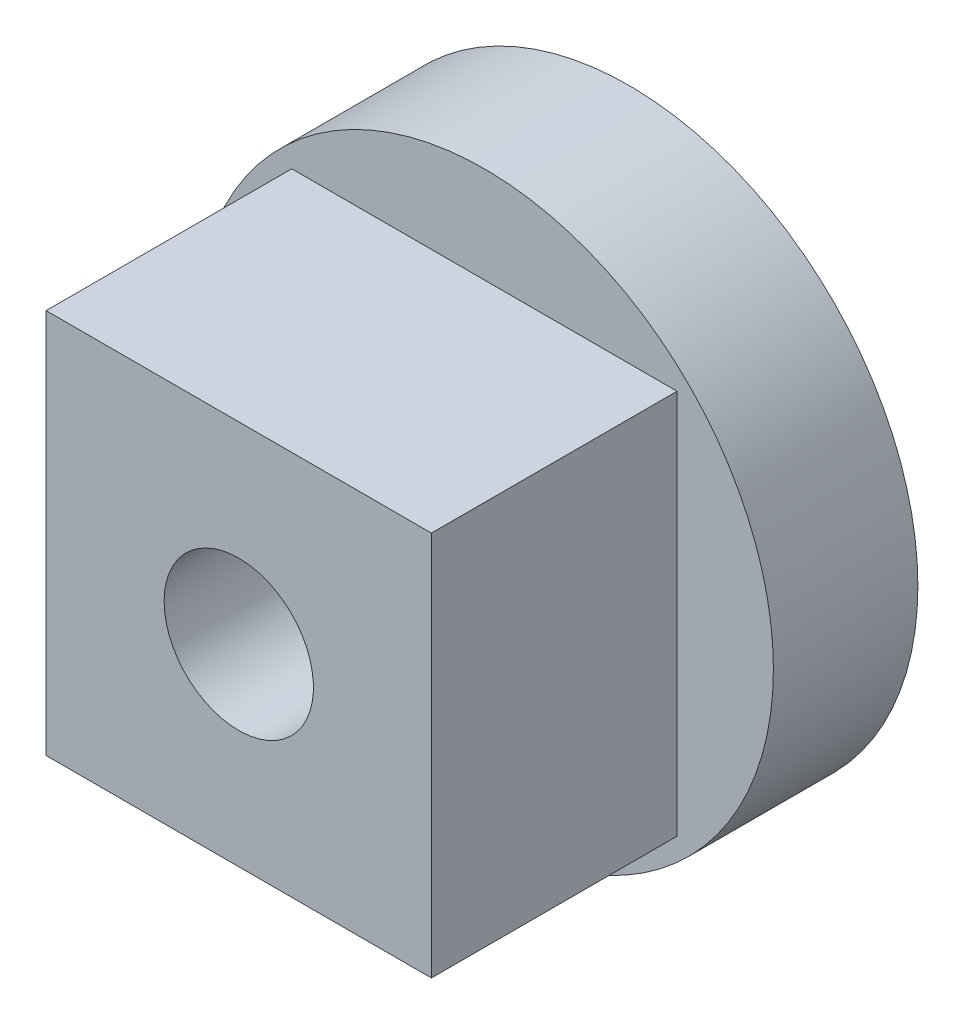
ISO-10303-21;
HEADER;
FILE_DESCRIPTION(('STEP AP214'),'2;1');
FILE_NAME('part.step','',(''),(''),'','','');
FILE_SCHEMA(('AUTOMOTIVE_DESIGN { 1 0 10303 214 1 1 1 1 }'));
ENDSEC;
DATA;
#1=APPLICATION_CONTEXT('core data for automotive mechanical design processes');
#2=APPLICATION_PROTOCOL_DEFINITION('international standard','automotive_design',2000,#1);
#3=PRODUCT_CONTEXT('',#1,'mechanical');
#4=PRODUCT('Part','Part','',(#3));
#5=PRODUCT_RELATED_PRODUCT_CATEGORY('part','',(#4));
#6=PRODUCT_DEFINITION_FORMATION('','',#4);
#7=PRODUCT_DEFINITION_CONTEXT('part definition',#1,'design');
#8=PRODUCT_DEFINITION('design','',#6,#7);
#9=PRODUCT_DEFINITION_SHAPE('','',#8);
#10=(LENGTH_UNIT() NAMED_UNIT(*) SI_UNIT(.MILLI.,.METRE.));
#11=(NAMED_UNIT(*) PLANE_ANGLE_UNIT() SI_UNIT($,.RADIAN.));
#12=(NAMED_UNIT(*) SI_UNIT($,.STERADIAN.) SOLID_ANGLE_UNIT());
#13=UNCERTAINTY_MEASURE_WITH_UNIT(LENGTH_MEASURE(1.E-05),#10,'distance_accuracy_value','');
#14=(GEOMETRIC_REPRESENTATION_CONTEXT(3) GLOBAL_UNCERTAINTY_ASSIGNED_CONTEXT((#13)) GLOBAL_UNIT_ASSIGNED_CONTEXT((#10,
#11,#12)) REPRESENTATION_CONTEXT('',''));
#15=CARTESIAN_POINT('',(0.,0.,0.));
#16=DIRECTION('',(0.,0.,1.));
#17=DIRECTION('',(1.,0.,0.));
#18=AXIS2_PLACEMENT_3D('',#15,#16,#17);
#19=CARTESIAN_POINT('',(0.,0.,3.));
#20=DIRECTION('',(0.,0.,-1.));
#21=DIRECTION('',(-1.,0.,0.));
#22=AXIS2_PLACEMENT_3D('',#19,#20,#21);
#23=CYLINDRICAL_SURFACE('',#22,6.);
#24=CARTESIAN_POINT('',(0.,0.,3.));
#25=DIRECTION('',(0.,0.,1.));
#26=DIRECTION('',(1.,0.,0.));
#27=AXIS2_PLACEMENT_3D('',#24,#25,#26);
#28=CIRCLE('',#27,6.);
#29=CARTESIAN_POINT('',(6.,0.,3.));
#30=VERTEX_POINT('',#29);
#31=EDGE_CURVE('E11',#30,#30,#28,.T.);
#32=ORIENTED_EDGE('',*,*,#31,.F.);
#33=EDGE_LOOP('',(#32));
#34=FACE_BOUND('',#33,.T.);
#35=CARTESIAN_POINT('',(0.,0.,0.));
#36=DIRECTION('',(0.,0.,1.));
#37=DIRECTION('',(1.,0.,0.));
#38=AXIS2_PLACEMENT_3D('',#35,#36,#37);
#39=CIRCLE('',#38,6.);
#40=CARTESIAN_POINT('',(6.,0.,0.));
#41=VERTEX_POINT('',#40);
#42=EDGE_CURVE('E42',#41,#41,#39,.T.);
#43=ORIENTED_EDGE('',*,*,#42,.T.);
#44=EDGE_LOOP('',(#43));
#45=FACE_BOUND('',#44,.T.);
#46=ADVANCED_FACE('F39',(#34,#45),#23,.T.);
#47=CARTESIAN_POINT('',(0.,0.,3.));
#48=DIRECTION('',(0.,0.,1.));
#49=DIRECTION('',(1.,0.,0.));
#50=AXIS2_PLACEMENT_3D('',#47,#48,#49);
#51=PLANE('',#50);
#52=DIRECTION('',(0.,-1.,0.));
#53=VECTOR('',#52,1.);
#54=CARTESIAN_POINT('',(-4.,-4.,3.));
#55=LINE('',#54,#53);
#56=CARTESIAN_POINT('',(-4.,4.,3.));
#57=VERTEX_POINT('',#56);
#58=CARTESIAN_POINT('',(-4.,-4.,3.));
#59=VERTEX_POINT('',#58);
#60=EDGE_CURVE('E53',#57,#59,#55,.T.);
#61=ORIENTED_EDGE('',*,*,#60,.F.);
#62=DIRECTION('',(-1.,0.,0.));
#63=VECTOR('',#62,1.);
#64=CARTESIAN_POINT('',(4.,4.,3.));
#65=LINE('',#64,#63);
#66=CARTESIAN_POINT('',(4.,4.,3.));
#67=VERTEX_POINT('',#66);
#68=EDGE_CURVE('E57',#67,#57,#65,.T.);
#69=ORIENTED_EDGE('',*,*,#68,.F.);
#70=DIRECTION('',(0.,1.,0.));
#71=VECTOR('',#70,1.);
#72=CARTESIAN_POINT('',(4.,-4.,3.));
#73=LINE('',#72,#71);
#74=CARTESIAN_POINT('',(4.,-4.,3.));
#75=VERTEX_POINT('',#74);
#76=EDGE_CURVE('E109',#75,#67,#73,.T.);
#77=ORIENTED_EDGE('',*,*,#76,.F.);
#78=DIRECTION('',(1.,0.,0.));
#79=VECTOR('',#78,1.);
#80=CARTESIAN_POINT('',(4.,-4.,3.));
#81=LINE('',#80,#79);
#82=EDGE_CURVE('E111',#59,#75,#81,.T.);
#83=ORIENTED_EDGE('',*,*,#82,.F.);
#84=EDGE_LOOP('',(#61,#69,#77,#83));
#85=FACE_BOUND('',#84,.T.);
#86=ORIENTED_EDGE('',*,*,#31,.T.);
#87=EDGE_LOOP('',(#86));
#88=FACE_BOUND('',#87,.T.);
#89=ADVANCED_FACE('F151',(#85,#88),#51,.T.);
#90=CARTESIAN_POINT('',(0.,0.,0.));
#91=DIRECTION('',(0.,0.,1.));
#92=DIRECTION('',(1.,0.,0.));
#93=AXIS2_PLACEMENT_3D('',#90,#91,#92);
#94=PLANE('',#93);
#95=CARTESIAN_POINT('',(0.,0.,0.));
#96=DIRECTION('',(0.,0.,-1.));
#97=DIRECTION('',(-1.,0.,0.));
#98=AXIS2_PLACEMENT_3D('',#95,#96,#97);
#99=CIRCLE('',#98,2.85);
#100=CARTESIAN_POINT('',(-2.85,0.,0.));
#101=VERTEX_POINT('',#100);
#102=EDGE_CURVE('E117',#101,#101,#99,.T.);
#103=ORIENTED_EDGE('',*,*,#102,.F.);
#104=EDGE_LOOP('',(#103));
#105=FACE_BOUND('',#104,.T.);
#106=ORIENTED_EDGE('',*,*,#42,.F.);
#107=EDGE_LOOP('',(#106));
#108=FACE_BOUND('',#107,.T.);
#109=ADVANCED_FACE('F148',(#105,#108),#94,.F.);
#110=CARTESIAN_POINT('',(-4.,-4.,8.1));
#111=DIRECTION('',(1.,0.,0.));
#112=DIRECTION('',(0.,0.,-1.));
#113=AXIS2_PLACEMENT_3D('',#110,#111,#112);
#114=PLANE('',#113);
#115=ORIENTED_EDGE('',*,*,#60,.T.);
#116=DIRECTION('',(0.,0.,-1.));
#117=VECTOR('',#116,1.);
#118=CARTESIAN_POINT('',(-4.,-4.,8.1));
#119=LINE('',#118,#117);
#120=CARTESIAN_POINT('',(-4.,-4.,8.1));
#121=VERTEX_POINT('',#120);
#122=EDGE_CURVE('E82',#121,#59,#119,.T.);
#123=ORIENTED_EDGE('',*,*,#122,.F.);
#124=DIRECTION('',(0.,-1.,0.));
#125=VECTOR('',#124,1.);
#126=CARTESIAN_POINT('',(-4.,-4.,8.1));
#127=LINE('',#126,#125);
#128=CARTESIAN_POINT('',(-4.,4.,8.1));
#129=VERTEX_POINT('',#128);
#130=EDGE_CURVE('E88',#129,#121,#127,.T.);
#131=ORIENTED_EDGE('',*,*,#130,.F.);
#132=DIRECTION('',(0.,0.,-1.));
#133=VECTOR('',#132,1.);
#134=CARTESIAN_POINT('',(-4.,4.,8.1));
#135=LINE('',#134,#133);
#136=EDGE_CURVE('E106',#129,#57,#135,.T.);
#137=ORIENTED_EDGE('',*,*,#136,.T.);
#138=EDGE_LOOP('',(#115,#123,#131,#137));
#139=FACE_BOUND('',#138,.T.);
#140=ADVANCED_FACE('F98',(#139),#114,.F.);
#141=CARTESIAN_POINT('',(4.,-4.,8.1));
#142=DIRECTION('',(0.,1.,0.));
#143=DIRECTION('',(0.,0.,1.));
#144=AXIS2_PLACEMENT_3D('',#141,#142,#143);
#145=PLANE('',#144);
#146=ORIENTED_EDGE('',*,*,#82,.T.);
#147=DIRECTION('',(0.,0.,-1.));
#148=VECTOR('',#147,1.);
#149=CARTESIAN_POINT('',(4.,-4.,8.1));
#150=LINE('',#149,#148);
#151=CARTESIAN_POINT('',(4.,-4.,8.1));
#152=VERTEX_POINT('',#151);
#153=EDGE_CURVE('E84',#152,#75,#150,.T.);
#154=ORIENTED_EDGE('',*,*,#153,.F.);
#155=DIRECTION('',(1.,0.,0.));
#156=VECTOR('',#155,1.);
#157=CARTESIAN_POINT('',(4.,-4.,8.1));
#158=LINE('',#157,#156);
#159=EDGE_CURVE('E77',#121,#152,#158,.T.);
#160=ORIENTED_EDGE('',*,*,#159,.F.);
#161=ORIENTED_EDGE('',*,*,#122,.T.);
#162=EDGE_LOOP('',(#146,#154,#160,#161));
#163=FACE_BOUND('',#162,.T.);
#164=ADVANCED_FACE('F80',(#163),#145,.F.);
#165=CARTESIAN_POINT('',(4.,-4.,8.1));
#166=DIRECTION('',(-1.,0.,0.));
#167=DIRECTION('',(0.,0.,1.));
#168=AXIS2_PLACEMENT_3D('',#165,#166,#167);
#169=PLANE('',#168);
#170=ORIENTED_EDGE('',*,*,#76,.T.);
#171=DIRECTION('',(0.,0.,-1.));
#172=VECTOR('',#171,1.);
#173=CARTESIAN_POINT('',(4.,4.,8.1));
#174=LINE('',#173,#172);
#175=CARTESIAN_POINT('',(4.,4.,8.1));
#176=VERTEX_POINT('',#175);
#177=EDGE_CURVE('E101',#176,#67,#174,.T.);
#178=ORIENTED_EDGE('',*,*,#177,.F.);
#179=DIRECTION('',(0.,1.,0.));
#180=VECTOR('',#179,1.);
#181=CARTESIAN_POINT('',(4.,-4.,8.1));
#182=LINE('',#181,#180);
#183=EDGE_CURVE('E87',#152,#176,#182,.T.);
#184=ORIENTED_EDGE('',*,*,#183,.F.);
#185=ORIENTED_EDGE('',*,*,#153,.T.);
#186=EDGE_LOOP('',(#170,#178,#184,#185));
#187=FACE_BOUND('',#186,.T.);
#188=ADVANCED_FACE('F169',(#187),#169,.F.);
#189=CARTESIAN_POINT('',(4.,4.,8.1));
#190=DIRECTION('',(0.,-1.,0.));
#191=DIRECTION('',(0.,0.,-1.));
#192=AXIS2_PLACEMENT_3D('',#189,#190,#191);
#193=PLANE('',#192);
#194=ORIENTED_EDGE('',*,*,#68,.T.);
#195=ORIENTED_EDGE('',*,*,#136,.F.);
#196=DIRECTION('',(-1.,0.,0.));
#197=VECTOR('',#196,1.);
#198=CARTESIAN_POINT('',(4.,4.,8.1));
#199=LINE('',#198,#197);
#200=EDGE_CURVE('E93',#176,#129,#199,.T.);
#201=ORIENTED_EDGE('',*,*,#200,.F.);
#202=ORIENTED_EDGE('',*,*,#177,.T.);
#203=EDGE_LOOP('',(#194,#195,#201,#202));
#204=FACE_BOUND('',#203,.T.);
#205=ADVANCED_FACE('F172',(#204),#193,.F.);
#206=CARTESIAN_POINT('',(0.,0.,8.1));
#207=DIRECTION('',(0.,0.,1.));
#208=DIRECTION('',(1.,0.,0.));
#209=AXIS2_PLACEMENT_3D('',#206,#207,#208);
#210=PLANE('',#209);
#211=CARTESIAN_POINT('',(0.,0.,8.1));
#212=DIRECTION('',(0.,0.,-1.));
#213=DIRECTION('',(-1.,0.,0.));
#214=AXIS2_PLACEMENT_3D('',#211,#212,#213);
#215=CIRCLE('',#214,1.55);
#216=CARTESIAN_POINT('',(-1.55,0.,8.1));
#217=VERTEX_POINT('',#216);
#218=EDGE_CURVE('E120',#217,#217,#215,.T.);
#219=ORIENTED_EDGE('',*,*,#218,.T.);
#220=EDGE_LOOP('',(#219));
#221=FACE_BOUND('',#220,.T.);
#222=ORIENTED_EDGE('',*,*,#130,.T.);
#223=ORIENTED_EDGE('',*,*,#159,.T.);
#224=ORIENTED_EDGE('',*,*,#183,.T.);
#225=ORIENTED_EDGE('',*,*,#200,.T.);
#226=EDGE_LOOP('',(#222,#223,#224,#225));
#227=FACE_BOUND('',#226,.T.);
#228=ADVANCED_FACE('F91',(#221,#227),#210,.T.);
#229=CARTESIAN_POINT('',(0.,0.,1.));
#230=DIRECTION('',(0.,0.,-1.));
#231=DIRECTION('',(-1.,0.,0.));
#232=AXIS2_PLACEMENT_3D('',#229,#230,#231);
#233=CYLINDRICAL_SURFACE('',#232,2.85);
#234=CARTESIAN_POINT('',(0.,0.,1.));
#235=DIRECTION('',(0.,0.,-1.));
#236=DIRECTION('',(-1.,0.,0.));
#237=AXIS2_PLACEMENT_3D('',#234,#235,#236);
#238=CIRCLE('',#237,2.85);
#239=CARTESIAN_POINT('',(-2.85,0.,1.));
#240=VERTEX_POINT('',#239);
#241=EDGE_CURVE('E114',#240,#240,#238,.T.);
#242=ORIENTED_EDGE('',*,*,#241,.F.);
#243=EDGE_LOOP('',(#242));
#244=FACE_BOUND('',#243,.T.);
#245=ORIENTED_EDGE('',*,*,#102,.T.);
#246=EDGE_LOOP('',(#245));
#247=FACE_BOUND('',#246,.T.);
#248=ADVANCED_FACE('F139',(#244,#247),#233,.F.);
#249=CARTESIAN_POINT('',(0.,0.,1.));
#250=DIRECTION('',(0.,0.,-1.));
#251=DIRECTION('',(-1.,0.,0.));
#252=AXIS2_PLACEMENT_3D('',#249,#250,#251);
#253=PLANE('',#252);
#254=CARTESIAN_POINT('',(0.,0.,1.));
#255=DIRECTION('',(0.,0.,-1.));
#256=DIRECTION('',(-1.,0.,0.));
#257=AXIS2_PLACEMENT_3D('',#254,#255,#256);
#258=CIRCLE('',#257,1.55);
#259=CARTESIAN_POINT('',(-1.55,0.,1.));
#260=VERTEX_POINT('',#259);
#261=EDGE_CURVE('E123',#260,#260,#258,.T.);
#262=ORIENTED_EDGE('',*,*,#261,.F.);
#263=EDGE_LOOP('',(#262));
#264=FACE_BOUND('',#263,.T.);
#265=ORIENTED_EDGE('',*,*,#241,.T.);
#266=EDGE_LOOP('',(#265));
#267=FACE_BOUND('',#266,.T.);
#268=ADVANCED_FACE('F133',(#264,#267),#253,.T.);
#269=CARTESIAN_POINT('',(0.,0.,8.1));
#270=DIRECTION('',(0.,0.,-1.));
#271=DIRECTION('',(-1.,0.,0.));
#272=AXIS2_PLACEMENT_3D('',#269,#270,#271);
#273=CYLINDRICAL_SURFACE('',#272,1.55);
#274=ORIENTED_EDGE('',*,*,#218,.F.);
#275=EDGE_LOOP('',(#274));
#276=FACE_BOUND('',#275,.T.);
#277=ORIENTED_EDGE('',*,*,#261,.T.);
#278=EDGE_LOOP('',(#277));
#279=FACE_BOUND('',#278,.T.);
#280=ADVANCED_FACE('F130',(#276,#279),#273,.F.);
#281=CLOSED_SHELL('',(#46,#89,#109,#140,#164,#188,#205,#228,#248,#268,#280));
#282=MANIFOLD_SOLID_BREP('B2',#281);
#283=ADVANCED_BREP_SHAPE_REPRESENTATION('',(#18,#282),#14);
#284=SHAPE_DEFINITION_REPRESENTATION(#9,#283);
ENDSEC;
END-ISO-10303-21;
